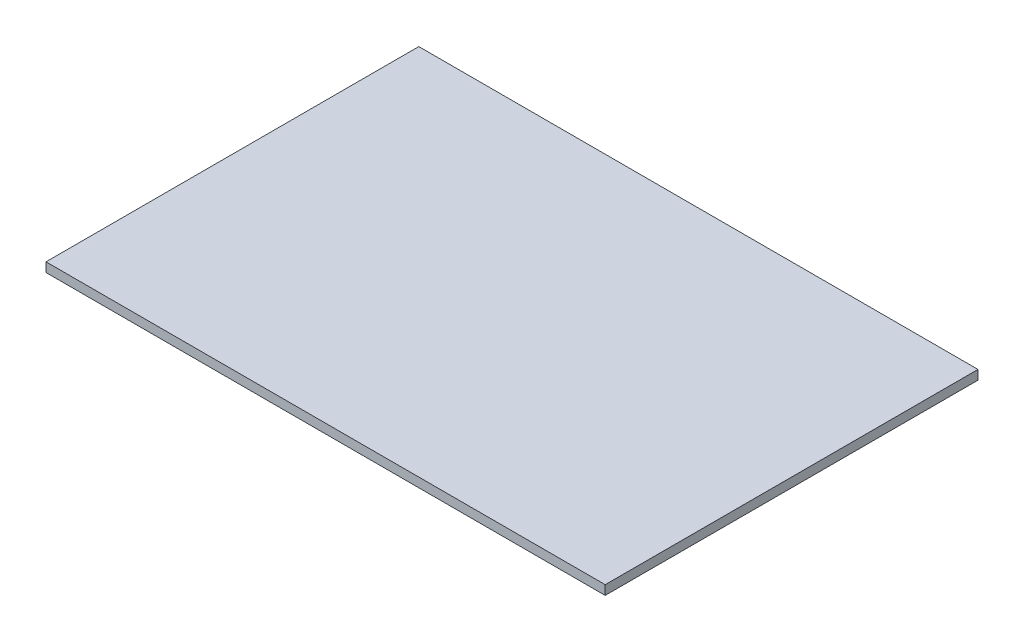
ISO-10303-21;
HEADER;
FILE_DESCRIPTION(('STEP AP214'),'2;1');
FILE_NAME('part.step','',(''),(''),'','','');
FILE_SCHEMA(('AUTOMOTIVE_DESIGN { 1 0 10303 214 1 1 1 1 }'));
ENDSEC;
DATA;
#1=APPLICATION_CONTEXT('core data for automotive mechanical design processes');
#2=APPLICATION_PROTOCOL_DEFINITION('international standard','automotive_design',2000,#1);
#3=PRODUCT_CONTEXT('',#1,'mechanical');
#4=PRODUCT('Part','Part','',(#3));
#5=PRODUCT_RELATED_PRODUCT_CATEGORY('part','',(#4));
#6=PRODUCT_DEFINITION_FORMATION('','',#4);
#7=PRODUCT_DEFINITION_CONTEXT('part definition',#1,'design');
#8=PRODUCT_DEFINITION('design','',#6,#7);
#9=PRODUCT_DEFINITION_SHAPE('','',#8);
#10=(LENGTH_UNIT() NAMED_UNIT(*) SI_UNIT(.MILLI.,.METRE.));
#11=(NAMED_UNIT(*) PLANE_ANGLE_UNIT() SI_UNIT($,.RADIAN.));
#12=(NAMED_UNIT(*) SI_UNIT($,.STERADIAN.) SOLID_ANGLE_UNIT());
#13=UNCERTAINTY_MEASURE_WITH_UNIT(LENGTH_MEASURE(1.E-05),#10,'distance_accuracy_value','');
#14=(GEOMETRIC_REPRESENTATION_CONTEXT(3) GLOBAL_UNCERTAINTY_ASSIGNED_CONTEXT((#13)) GLOBAL_UNIT_ASSIGNED_CONTEXT((#10,
#11,#12)) REPRESENTATION_CONTEXT('',''));
#15=CARTESIAN_POINT('',(0.,0.,0.));
#16=DIRECTION('',(0.,0.,1.));
#17=DIRECTION('',(1.,0.,0.));
#18=AXIS2_PLACEMENT_3D('',#15,#16,#17);
#19=CARTESIAN_POINT('',(-8.2395259322691,1.,-35.2387515544689));
#20=DIRECTION('',(1.,0.,0.));
#21=DIRECTION('',(0.,0.,-1.));
#22=AXIS2_PLACEMENT_3D('',#19,#20,#21);
#23=PLANE('',#22);
#24=DIRECTION('',(0.,0.,1.));
#25=VECTOR('',#24,1.);
#26=CARTESIAN_POINT('',(-8.2395259322691,0.,-35.2387515544689));
#27=LINE('',#26,#25);
#28=CARTESIAN_POINT('',(-8.2395259322691,0.,-35.2387515544689));
#29=VERTEX_POINT('',#28);
#30=CARTESIAN_POINT('',(-8.2395259322691,0.,4.76124844553113));
#31=VERTEX_POINT('',#30);
#32=EDGE_CURVE('E100',#29,#31,#27,.T.);
#33=ORIENTED_EDGE('',*,*,#32,.T.);
#34=DIRECTION('',(0.,-1.,0.));
#35=VECTOR('',#34,1.);
#36=CARTESIAN_POINT('',(-8.2395259322691,1.,4.76124844553113));
#37=LINE('',#36,#35);
#38=CARTESIAN_POINT('',(-8.2395259322691,1.,4.76124844553113));
#39=VERTEX_POINT('',#38);
#40=EDGE_CURVE('E11',#39,#31,#37,.T.);
#41=ORIENTED_EDGE('',*,*,#40,.F.);
#42=DIRECTION('',(0.,0.,1.));
#43=VECTOR('',#42,1.);
#44=CARTESIAN_POINT('',(-8.2395259322691,1.,-35.2387515544689));
#45=LINE('',#44,#43);
#46=CARTESIAN_POINT('',(-8.2395259322691,1.,-35.2387515544689));
#47=VERTEX_POINT('',#46);
#48=EDGE_CURVE('E88',#47,#39,#45,.T.);
#49=ORIENTED_EDGE('',*,*,#48,.F.);
#50=DIRECTION('',(0.,-1.,0.));
#51=VECTOR('',#50,1.);
#52=CARTESIAN_POINT('',(-8.2395259322691,1.,-35.2387515544689));
#53=LINE('',#52,#51);
#54=EDGE_CURVE('E96',#47,#29,#53,.T.);
#55=ORIENTED_EDGE('',*,*,#54,.T.);
#56=EDGE_LOOP('',(#33,#41,#49,#55));
#57=FACE_BOUND('',#56,.T.);
#58=ADVANCED_FACE('F37',(#57),#23,.F.);
#59=CARTESIAN_POINT('',(-8.2395259322691,1.,4.76124844553113));
#60=DIRECTION('',(0.,0.,-1.));
#61=DIRECTION('',(-1.,0.,0.));
#62=AXIS2_PLACEMENT_3D('',#59,#60,#61);
#63=PLANE('',#62);
#64=DIRECTION('',(1.,0.,0.));
#65=VECTOR('',#64,1.);
#66=CARTESIAN_POINT('',(-8.2395259322691,0.,4.76124844553113));
#67=LINE('',#66,#65);
#68=CARTESIAN_POINT('',(51.7604740677309,0.,4.76124844553113));
#69=VERTEX_POINT('',#68);
#70=EDGE_CURVE('E92',#31,#69,#67,.T.);
#71=ORIENTED_EDGE('',*,*,#70,.T.);
#72=DIRECTION('',(0.,-1.,0.));
#73=VECTOR('',#72,1.);
#74=CARTESIAN_POINT('',(51.7604740677309,1.,4.76124844553113));
#75=LINE('',#74,#73);
#76=CARTESIAN_POINT('',(51.7604740677309,1.,4.76124844553113));
#77=VERTEX_POINT('',#76);
#78=EDGE_CURVE('E45',#77,#69,#75,.T.);
#79=ORIENTED_EDGE('',*,*,#78,.F.);
#80=DIRECTION('',(1.,0.,0.));
#81=VECTOR('',#80,1.);
#82=CARTESIAN_POINT('',(-8.2395259322691,1.,4.76124844553113));
#83=LINE('',#82,#81);
#84=EDGE_CURVE('E83',#39,#77,#83,.T.);
#85=ORIENTED_EDGE('',*,*,#84,.F.);
#86=ORIENTED_EDGE('',*,*,#40,.T.);
#87=EDGE_LOOP('',(#71,#79,#85,#86));
#88=FACE_BOUND('',#87,.T.);
#89=ADVANCED_FACE('F91',(#88),#63,.F.);
#90=CARTESIAN_POINT('',(51.7604740677309,1.,4.76124844553113));
#91=DIRECTION('',(-1.,0.,0.));
#92=DIRECTION('',(0.,0.,1.));
#93=AXIS2_PLACEMENT_3D('',#90,#91,#92);
#94=PLANE('',#93);
#95=DIRECTION('',(0.,0.,-1.));
#96=VECTOR('',#95,1.);
#97=CARTESIAN_POINT('',(51.7604740677309,0.,4.76124844553113));
#98=LINE('',#97,#96);
#99=CARTESIAN_POINT('',(51.7604740677309,0.,-35.2387515544689));
#100=VERTEX_POINT('',#99);
#101=EDGE_CURVE('E70',#69,#100,#98,.T.);
#102=ORIENTED_EDGE('',*,*,#101,.T.);
#103=DIRECTION('',(0.,-1.,0.));
#104=VECTOR('',#103,1.);
#105=CARTESIAN_POINT('',(51.7604740677309,1.,-35.2387515544689));
#106=LINE('',#105,#104);
#107=CARTESIAN_POINT('',(51.7604740677309,1.,-35.2387515544689));
#108=VERTEX_POINT('',#107);
#109=EDGE_CURVE('E93',#108,#100,#106,.T.);
#110=ORIENTED_EDGE('',*,*,#109,.F.);
#111=DIRECTION('',(0.,0.,-1.));
#112=VECTOR('',#111,1.);
#113=CARTESIAN_POINT('',(51.7604740677309,1.,4.76124844553113));
#114=LINE('',#113,#112);
#115=EDGE_CURVE('E86',#77,#108,#114,.T.);
#116=ORIENTED_EDGE('',*,*,#115,.F.);
#117=ORIENTED_EDGE('',*,*,#78,.T.);
#118=EDGE_LOOP('',(#102,#110,#116,#117));
#119=FACE_BOUND('',#118,.T.);
#120=ADVANCED_FACE('F94',(#119),#94,.F.);
#121=CARTESIAN_POINT('',(51.7604740677309,1.,-35.2387515544689));
#122=DIRECTION('',(0.,0.,1.));
#123=DIRECTION('',(1.,0.,0.));
#124=AXIS2_PLACEMENT_3D('',#121,#122,#123);
#125=PLANE('',#124);
#126=DIRECTION('',(-1.,0.,0.));
#127=VECTOR('',#126,1.);
#128=CARTESIAN_POINT('',(51.7604740677309,0.,-35.2387515544689));
#129=LINE('',#128,#127);
#130=EDGE_CURVE('E76',#100,#29,#129,.T.);
#131=ORIENTED_EDGE('',*,*,#130,.T.);
#132=ORIENTED_EDGE('',*,*,#54,.F.);
#133=DIRECTION('',(-1.,0.,0.));
#134=VECTOR('',#133,1.);
#135=CARTESIAN_POINT('',(51.7604740677309,1.,-35.2387515544689));
#136=LINE('',#135,#134);
#137=EDGE_CURVE('E53',#108,#47,#136,.T.);
#138=ORIENTED_EDGE('',*,*,#137,.F.);
#139=ORIENTED_EDGE('',*,*,#109,.T.);
#140=EDGE_LOOP('',(#131,#132,#138,#139));
#141=FACE_BOUND('',#140,.T.);
#142=ADVANCED_FACE('F107',(#141),#125,.F.);
#143=CARTESIAN_POINT('',(0.,1.,0.));
#144=DIRECTION('',(0.,1.,0.));
#145=DIRECTION('',(0.,0.,1.));
#146=AXIS2_PLACEMENT_3D('',#143,#144,#145);
#147=PLANE('',#146);
#148=ORIENTED_EDGE('',*,*,#48,.T.);
#149=ORIENTED_EDGE('',*,*,#84,.T.);
#150=ORIENTED_EDGE('',*,*,#115,.T.);
#151=ORIENTED_EDGE('',*,*,#137,.T.);
#152=EDGE_LOOP('',(#148,#149,#150,#151));
#153=FACE_BOUND('',#152,.T.);
#154=ADVANCED_FACE('F84',(#153),#147,.T.);
#155=CARTESIAN_POINT('',(0.,0.,0.));
#156=DIRECTION('',(0.,1.,0.));
#157=DIRECTION('',(0.,0.,1.));
#158=AXIS2_PLACEMENT_3D('',#155,#156,#157);
#159=PLANE('',#158);
#160=ORIENTED_EDGE('',*,*,#32,.F.);
#161=ORIENTED_EDGE('',*,*,#130,.F.);
#162=ORIENTED_EDGE('',*,*,#101,.F.);
#163=ORIENTED_EDGE('',*,*,#70,.F.);
#164=EDGE_LOOP('',(#160,#161,#162,#163));
#165=FACE_BOUND('',#164,.T.);
#166=ADVANCED_FACE('F110',(#165),#159,.F.);
#167=CLOSED_SHELL('',(#58,#89,#120,#142,#154,#166));
#168=MANIFOLD_SOLID_BREP('B2',#167);
#169=ADVANCED_BREP_SHAPE_REPRESENTATION('',(#18,#168),#14);
#170=SHAPE_DEFINITION_REPRESENTATION(#9,#169);
ENDSEC;
END-ISO-10303-21;
